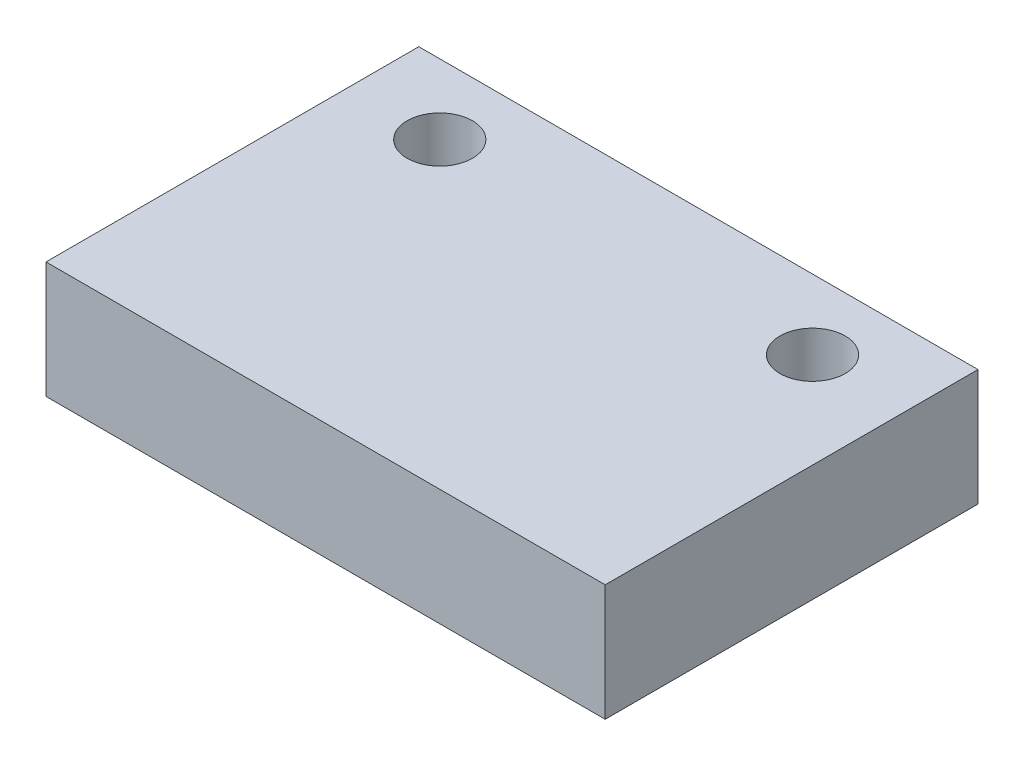
ISO-10303-21;
HEADER;
FILE_DESCRIPTION(('STEP AP214'),'2;1');
FILE_NAME('part.step','',(''),(''),'','','');
FILE_SCHEMA(('AUTOMOTIVE_DESIGN { 1 0 10303 214 1 1 1 1 }'));
ENDSEC;
DATA;
#1=APPLICATION_CONTEXT('core data for automotive mechanical design processes');
#2=APPLICATION_PROTOCOL_DEFINITION('international standard','automotive_design',2000,#1);
#3=PRODUCT_CONTEXT('',#1,'mechanical');
#4=PRODUCT('Part','Part','',(#3));
#5=PRODUCT_RELATED_PRODUCT_CATEGORY('part','',(#4));
#6=PRODUCT_DEFINITION_FORMATION('','',#4);
#7=PRODUCT_DEFINITION_CONTEXT('part definition',#1,'design');
#8=PRODUCT_DEFINITION('design','',#6,#7);
#9=PRODUCT_DEFINITION_SHAPE('','',#8);
#10=(LENGTH_UNIT() NAMED_UNIT(*) SI_UNIT(.MILLI.,.METRE.));
#11=(NAMED_UNIT(*) PLANE_ANGLE_UNIT() SI_UNIT($,.RADIAN.));
#12=(NAMED_UNIT(*) SI_UNIT($,.STERADIAN.) SOLID_ANGLE_UNIT());
#13=UNCERTAINTY_MEASURE_WITH_UNIT(LENGTH_MEASURE(1.E-05),#10,'distance_accuracy_value','');
#14=(GEOMETRIC_REPRESENTATION_CONTEXT(3) GLOBAL_UNCERTAINTY_ASSIGNED_CONTEXT((#13)) GLOBAL_UNIT_ASSIGNED_CONTEXT((#10,
#11,#12)) REPRESENTATION_CONTEXT('',''));
#15=CARTESIAN_POINT('',(0.,0.,0.));
#16=DIRECTION('',(0.,0.,1.));
#17=DIRECTION('',(1.,0.,0.));
#18=AXIS2_PLACEMENT_3D('',#15,#16,#17);
#19=CARTESIAN_POINT('',(0.,30.,0.));
#20=DIRECTION('',(0.,1.,0.));
#21=DIRECTION('',(0.,0.,1.));
#22=AXIS2_PLACEMENT_3D('',#19,#20,#21);
#23=PLANE('',#22);
#24=CARTESIAN_POINT('',(-40.5,30.,-25.));
#25=DIRECTION('',(0.,1.,0.));
#26=DIRECTION('',(0.,0.,1.));
#27=AXIS2_PLACEMENT_3D('',#24,#25,#26);
#28=CIRCLE('',#27,7.);
#29=CARTESIAN_POINT('',(-40.5,30.,-18.));
#30=VERTEX_POINT('',#29);
#31=EDGE_CURVE('E90',#30,#30,#28,.F.);
#32=ORIENTED_EDGE('',*,*,#31,.T.);
#33=EDGE_LOOP('',(#32));
#34=FACE_BOUND('',#33,.T.);
#35=CARTESIAN_POINT('',(39.5,30.,-25.));
#36=DIRECTION('',(0.,-1.,0.));
#37=DIRECTION('',(0.,0.,-1.));
#38=AXIS2_PLACEMENT_3D('',#35,#36,#37);
#39=CIRCLE('',#38,7.);
#40=CARTESIAN_POINT('',(39.5,30.,-32.));
#41=VERTEX_POINT('',#40);
#42=EDGE_CURVE('E27',#41,#41,#39,.T.);
#43=ORIENTED_EDGE('',*,*,#42,.T.);
#44=EDGE_LOOP('',(#43));
#45=FACE_BOUND('',#44,.T.);
#46=DIRECTION('',(-1.,0.,0.));
#47=VECTOR('',#46,1.);
#48=CARTESIAN_POINT('',(60.0000000000001,30.,-40.));
#49=LINE('',#48,#47);
#50=CARTESIAN_POINT('',(-60.,30.,-40.));
#51=VERTEX_POINT('',#50);
#52=CARTESIAN_POINT('',(60.0000000000001,30.,-40.));
#53=VERTEX_POINT('',#52);
#54=EDGE_CURVE('E67',#51,#53,#49,.F.);
#55=ORIENTED_EDGE('',*,*,#54,.F.);
#56=DIRECTION('',(0.,0.,1.));
#57=VECTOR('',#56,1.);
#58=CARTESIAN_POINT('',(-60.,30.,-40.));
#59=LINE('',#58,#57);
#60=CARTESIAN_POINT('',(-60.,30.,40.));
#61=VERTEX_POINT('',#60);
#62=EDGE_CURVE('E99',#61,#51,#59,.F.);
#63=ORIENTED_EDGE('',*,*,#62,.F.);
#64=DIRECTION('',(1.,0.,0.));
#65=VECTOR('',#64,1.);
#66=CARTESIAN_POINT('',(-60.,30.,40.));
#67=LINE('',#66,#65);
#68=CARTESIAN_POINT('',(60.0000000000001,30.,40.));
#69=VERTEX_POINT('',#68);
#70=EDGE_CURVE('E77',#69,#61,#67,.F.);
#71=ORIENTED_EDGE('',*,*,#70,.F.);
#72=DIRECTION('',(0.,0.,-1.));
#73=VECTOR('',#72,1.);
#74=CARTESIAN_POINT('',(60.0000000000001,30.,40.));
#75=LINE('',#74,#73);
#76=EDGE_CURVE('E62',#53,#69,#75,.F.);
#77=ORIENTED_EDGE('',*,*,#76,.F.);
#78=EDGE_LOOP('',(#55,#63,#71,#77));
#79=FACE_BOUND('',#78,.T.);
#80=ADVANCED_FACE('F24',(#34,#45,#79),#23,.T.);
#81=CARTESIAN_POINT('',(59.9999999999999,0.,-40.));
#82=DIRECTION('',(0.,0.,-1.));
#83=DIRECTION('',(-1.,0.,0.));
#84=AXIS2_PLACEMENT_3D('',#81,#82,#83);
#85=PLANE('',#84);
#86=DIRECTION('',(0.,1.,0.));
#87=VECTOR('',#86,1.);
#88=CARTESIAN_POINT('',(59.9999999999999,0.,-40.));
#89=LINE('',#88,#87);
#90=CARTESIAN_POINT('',(59.9999999999999,5.,-40.));
#91=VERTEX_POINT('',#90);
#92=EDGE_CURVE('E69',#91,#53,#89,.T.);
#93=ORIENTED_EDGE('',*,*,#92,.F.);
#94=DIRECTION('',(1.,0.,0.));
#95=VECTOR('',#94,1.);
#96=CARTESIAN_POINT('',(-0.5,5.,-40.));
#97=LINE('',#96,#95);
#98=CARTESIAN_POINT('',(-60.,5.,-40.));
#99=VERTEX_POINT('',#98);
#100=EDGE_CURVE('E92',#99,#91,#97,.T.);
#101=ORIENTED_EDGE('',*,*,#100,.F.);
#102=DIRECTION('',(0.,1.,0.));
#103=VECTOR('',#102,1.);
#104=CARTESIAN_POINT('',(-60.,0.,-40.));
#105=LINE('',#104,#103);
#106=EDGE_CURVE('E72',#51,#99,#105,.F.);
#107=ORIENTED_EDGE('',*,*,#106,.F.);
#108=ORIENTED_EDGE('',*,*,#54,.T.);
#109=EDGE_LOOP('',(#93,#101,#107,#108));
#110=FACE_BOUND('',#109,.T.);
#111=ADVANCED_FACE('F68',(#110),#85,.T.);
#112=CARTESIAN_POINT('',(59.9999999999999,0.,40.));
#113=DIRECTION('',(1.,0.,0.));
#114=DIRECTION('',(0.,0.,-1.));
#115=AXIS2_PLACEMENT_3D('',#112,#113,#114);
#116=PLANE('',#115);
#117=DIRECTION('',(0.,1.,0.));
#118=VECTOR('',#117,1.);
#119=CARTESIAN_POINT('',(59.9999999999999,0.,40.));
#120=LINE('',#119,#118);
#121=CARTESIAN_POINT('',(59.9999999999999,5.,40.));
#122=VERTEX_POINT('',#121);
#123=EDGE_CURVE('E79',#122,#69,#120,.T.);
#124=ORIENTED_EDGE('',*,*,#123,.F.);
#125=DIRECTION('',(0.,0.,-1.));
#126=VECTOR('',#125,1.);
#127=CARTESIAN_POINT('',(59.9999999999999,5.,25.));
#128=LINE('',#127,#126);
#129=EDGE_CURVE('E83',#91,#122,#128,.F.);
#130=ORIENTED_EDGE('',*,*,#129,.F.);
#131=ORIENTED_EDGE('',*,*,#92,.T.);
#132=ORIENTED_EDGE('',*,*,#76,.T.);
#133=EDGE_LOOP('',(#124,#130,#131,#132));
#134=FACE_BOUND('',#133,.T.);
#135=ADVANCED_FACE('F81',(#134),#116,.T.);
#136=CARTESIAN_POINT('',(-60.,0.,40.));
#137=DIRECTION('',(0.,0.,1.));
#138=DIRECTION('',(1.,0.,0.));
#139=AXIS2_PLACEMENT_3D('',#136,#137,#138);
#140=PLANE('',#139);
#141=DIRECTION('',(0.,1.,0.));
#142=VECTOR('',#141,1.);
#143=CARTESIAN_POINT('',(-60.,0.,40.));
#144=LINE('',#143,#142);
#145=CARTESIAN_POINT('',(-60.,5.,40.));
#146=VERTEX_POINT('',#145);
#147=EDGE_CURVE('E42',#146,#61,#144,.T.);
#148=ORIENTED_EDGE('',*,*,#147,.F.);
#149=DIRECTION('',(1.,0.,0.));
#150=VECTOR('',#149,1.);
#151=CARTESIAN_POINT('',(-0.5,5.,40.));
#152=LINE('',#151,#150);
#153=EDGE_CURVE('E109',#122,#146,#152,.F.);
#154=ORIENTED_EDGE('',*,*,#153,.F.);
#155=ORIENTED_EDGE('',*,*,#123,.T.);
#156=ORIENTED_EDGE('',*,*,#70,.T.);
#157=EDGE_LOOP('',(#148,#154,#155,#156));
#158=FACE_BOUND('',#157,.T.);
#159=ADVANCED_FACE('F107',(#158),#140,.T.);
#160=CARTESIAN_POINT('',(-60.,0.,-40.));
#161=DIRECTION('',(-1.,0.,0.));
#162=DIRECTION('',(0.,0.,1.));
#163=AXIS2_PLACEMENT_3D('',#160,#161,#162);
#164=PLANE('',#163);
#165=ORIENTED_EDGE('',*,*,#106,.T.);
#166=DIRECTION('',(0.,0.,-1.));
#167=VECTOR('',#166,1.);
#168=CARTESIAN_POINT('',(-60.,5.,25.));
#169=LINE('',#168,#167);
#170=EDGE_CURVE('E89',#146,#99,#169,.T.);
#171=ORIENTED_EDGE('',*,*,#170,.F.);
#172=ORIENTED_EDGE('',*,*,#147,.T.);
#173=ORIENTED_EDGE('',*,*,#62,.T.);
#174=EDGE_LOOP('',(#165,#171,#172,#173));
#175=FACE_BOUND('',#174,.T.);
#176=ADVANCED_FACE('F114',(#175),#164,.T.);
#177=CARTESIAN_POINT('',(39.5,48.5163255499,-25.));
#178=DIRECTION('',(0.,-1.,0.));
#179=DIRECTION('',(0.,0.,-1.));
#180=AXIS2_PLACEMENT_3D('',#177,#178,#179);
#181=CYLINDRICAL_SURFACE('',#180,7.);
#182=ORIENTED_EDGE('',*,*,#42,.F.);
#183=EDGE_LOOP('',(#182));
#184=FACE_BOUND('',#183,.T.);
#185=CARTESIAN_POINT('',(39.5,5.,-25.));
#186=DIRECTION('',(0.,-1.,0.));
#187=DIRECTION('',(0.,0.,-1.));
#188=AXIS2_PLACEMENT_3D('',#185,#186,#187);
#189=CIRCLE('',#188,7.);
#190=CARTESIAN_POINT('',(39.5,5.,-32.));
#191=VERTEX_POINT('',#190);
#192=EDGE_CURVE('E33',#191,#191,#189,.F.);
#193=ORIENTED_EDGE('',*,*,#192,.F.);
#194=EDGE_LOOP('',(#193));
#195=FACE_BOUND('',#194,.T.);
#196=ADVANCED_FACE('F116',(#184,#195),#181,.F.);
#197=CARTESIAN_POINT('',(-40.5,48.5163255499,-25.));
#198=DIRECTION('',(0.,1.,0.));
#199=DIRECTION('',(0.,0.,1.));
#200=AXIS2_PLACEMENT_3D('',#197,#198,#199);
#201=CYLINDRICAL_SURFACE('',#200,7.);
#202=ORIENTED_EDGE('',*,*,#31,.F.);
#203=EDGE_LOOP('',(#202));
#204=FACE_BOUND('',#203,.T.);
#205=CARTESIAN_POINT('',(-40.5,5.,-25.));
#206=DIRECTION('',(0.,1.,0.));
#207=DIRECTION('',(0.,0.,1.));
#208=AXIS2_PLACEMENT_3D('',#205,#206,#207);
#209=CIRCLE('',#208,7.);
#210=CARTESIAN_POINT('',(-40.5,5.,-18.));
#211=VERTEX_POINT('',#210);
#212=EDGE_CURVE('E13',#211,#211,#209,.T.);
#213=ORIENTED_EDGE('',*,*,#212,.F.);
#214=EDGE_LOOP('',(#213));
#215=FACE_BOUND('',#214,.T.);
#216=ADVANCED_FACE('F123',(#204,#215),#201,.F.);
#217=CARTESIAN_POINT('',(-0.5,5.,25.));
#218=DIRECTION('',(0.,-1.,0.));
#219=DIRECTION('',(0.,0.,-1.));
#220=AXIS2_PLACEMENT_3D('',#217,#218,#219);
#221=PLANE('',#220);
#222=ORIENTED_EDGE('',*,*,#212,.T.);
#223=EDGE_LOOP('',(#222));
#224=FACE_BOUND('',#223,.T.);
#225=ORIENTED_EDGE('',*,*,#192,.T.);
#226=EDGE_LOOP('',(#225));
#227=FACE_BOUND('',#226,.T.);
#228=ORIENTED_EDGE('',*,*,#153,.T.);
#229=ORIENTED_EDGE('',*,*,#170,.T.);
#230=ORIENTED_EDGE('',*,*,#100,.T.);
#231=ORIENTED_EDGE('',*,*,#129,.T.);
#232=EDGE_LOOP('',(#228,#229,#230,#231));
#233=FACE_BOUND('',#232,.T.);
#234=ADVANCED_FACE('F112',(#224,#227,#233),#221,.T.);
#235=CLOSED_SHELL('',(#80,#111,#135,#159,#176,#196,#216,#234));
#236=MANIFOLD_SOLID_BREP('B1',#235);
#237=ADVANCED_BREP_SHAPE_REPRESENTATION('',(#18,#236),#14);
#238=SHAPE_DEFINITION_REPRESENTATION(#9,#237);
ENDSEC;
END-ISO-10303-21;
